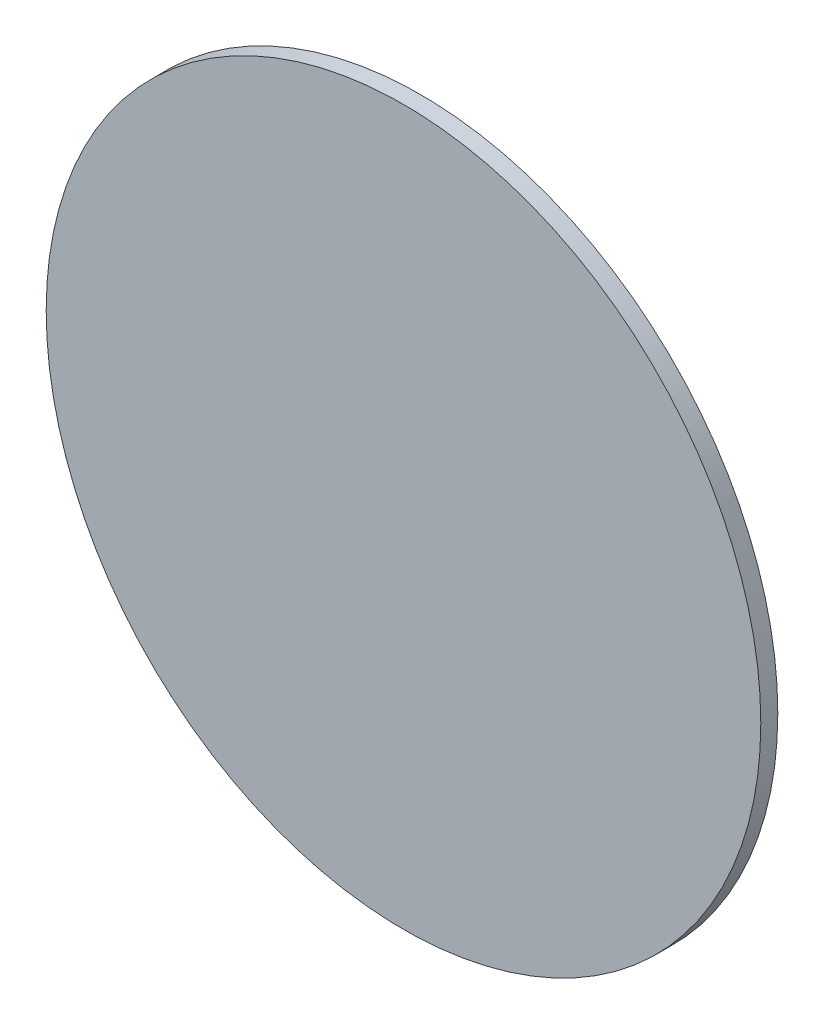
ISO-10303-21;
HEADER;
FILE_DESCRIPTION(('STEP AP214'),'2;1');
FILE_NAME('part.step','',(''),(''),'','','');
FILE_SCHEMA(('AUTOMOTIVE_DESIGN { 1 0 10303 214 1 1 1 1 }'));
ENDSEC;
DATA;
#1=APPLICATION_CONTEXT('core data for automotive mechanical design processes');
#2=APPLICATION_PROTOCOL_DEFINITION('international standard','automotive_design',2000,#1);
#3=PRODUCT_CONTEXT('',#1,'mechanical');
#4=PRODUCT('Part','Part','',(#3));
#5=PRODUCT_RELATED_PRODUCT_CATEGORY('part','',(#4));
#6=PRODUCT_DEFINITION_FORMATION('','',#4);
#7=PRODUCT_DEFINITION_CONTEXT('part definition',#1,'design');
#8=PRODUCT_DEFINITION('design','',#6,#7);
#9=PRODUCT_DEFINITION_SHAPE('','',#8);
#10=(LENGTH_UNIT() NAMED_UNIT(*) SI_UNIT(.MILLI.,.METRE.));
#11=(NAMED_UNIT(*) PLANE_ANGLE_UNIT() SI_UNIT($,.RADIAN.));
#12=(NAMED_UNIT(*) SI_UNIT($,.STERADIAN.) SOLID_ANGLE_UNIT());
#13=UNCERTAINTY_MEASURE_WITH_UNIT(LENGTH_MEASURE(1.E-05),#10,'distance_accuracy_value','');
#14=(GEOMETRIC_REPRESENTATION_CONTEXT(3) GLOBAL_UNCERTAINTY_ASSIGNED_CONTEXT((#13)) GLOBAL_UNIT_ASSIGNED_CONTEXT((#10,
#11,#12)) REPRESENTATION_CONTEXT('',''));
#15=CARTESIAN_POINT('',(0.,0.,0.));
#16=DIRECTION('',(0.,0.,1.));
#17=DIRECTION('',(1.,0.,0.));
#18=AXIS2_PLACEMENT_3D('',#15,#16,#17);
#19=CARTESIAN_POINT('',(0.,0.,1.));
#20=DIRECTION('',(0.,0.,-1.));
#21=DIRECTION('',(-1.,0.,0.));
#22=AXIS2_PLACEMENT_3D('',#19,#20,#21);
#23=CYLINDRICAL_SURFACE('',#22,21.);
#24=CARTESIAN_POINT('',(0.,0.,1.));
#25=DIRECTION('',(0.,0.,1.));
#26=DIRECTION('',(1.,0.,0.));
#27=AXIS2_PLACEMENT_3D('',#24,#25,#26);
#28=CIRCLE('',#27,21.);
#29=CARTESIAN_POINT('',(21.,0.,1.));
#30=VERTEX_POINT('',#29);
#31=EDGE_CURVE('E10',#30,#30,#28,.T.);
#32=ORIENTED_EDGE('',*,*,#31,.F.);
#33=EDGE_LOOP('',(#32));
#34=FACE_BOUND('',#33,.T.);
#35=CARTESIAN_POINT('',(0.,0.,0.));
#36=DIRECTION('',(0.,0.,1.));
#37=DIRECTION('',(1.,0.,0.));
#38=AXIS2_PLACEMENT_3D('',#35,#36,#37);
#39=CIRCLE('',#38,21.);
#40=CARTESIAN_POINT('',(21.,0.,0.));
#41=VERTEX_POINT('',#40);
#42=EDGE_CURVE('E35',#41,#41,#39,.T.);
#43=ORIENTED_EDGE('',*,*,#42,.T.);
#44=EDGE_LOOP('',(#43));
#45=FACE_BOUND('',#44,.T.);
#46=ADVANCED_FACE('F32',(#34,#45),#23,.T.);
#47=CARTESIAN_POINT('',(0.,0.,1.));
#48=DIRECTION('',(0.,0.,1.));
#49=DIRECTION('',(1.,0.,0.));
#50=AXIS2_PLACEMENT_3D('',#47,#48,#49);
#51=PLANE('',#50);
#52=ORIENTED_EDGE('',*,*,#31,.T.);
#53=EDGE_LOOP('',(#52));
#54=FACE_BOUND('',#53,.T.);
#55=ADVANCED_FACE('F47',(#54),#51,.T.);
#56=CARTESIAN_POINT('',(0.,0.,0.));
#57=DIRECTION('',(0.,0.,1.));
#58=DIRECTION('',(1.,0.,0.));
#59=AXIS2_PLACEMENT_3D('',#56,#57,#58);
#60=PLANE('',#59);
#61=ORIENTED_EDGE('',*,*,#42,.F.);
#62=EDGE_LOOP('',(#61));
#63=FACE_BOUND('',#62,.T.);
#64=ADVANCED_FACE('F45',(#63),#60,.F.);
#65=CLOSED_SHELL('',(#46,#55,#64));
#66=MANIFOLD_SOLID_BREP('B2',#65);
#67=ADVANCED_BREP_SHAPE_REPRESENTATION('',(#18,#66),#14);
#68=SHAPE_DEFINITION_REPRESENTATION(#9,#67);
ENDSEC;
END-ISO-10303-21;
